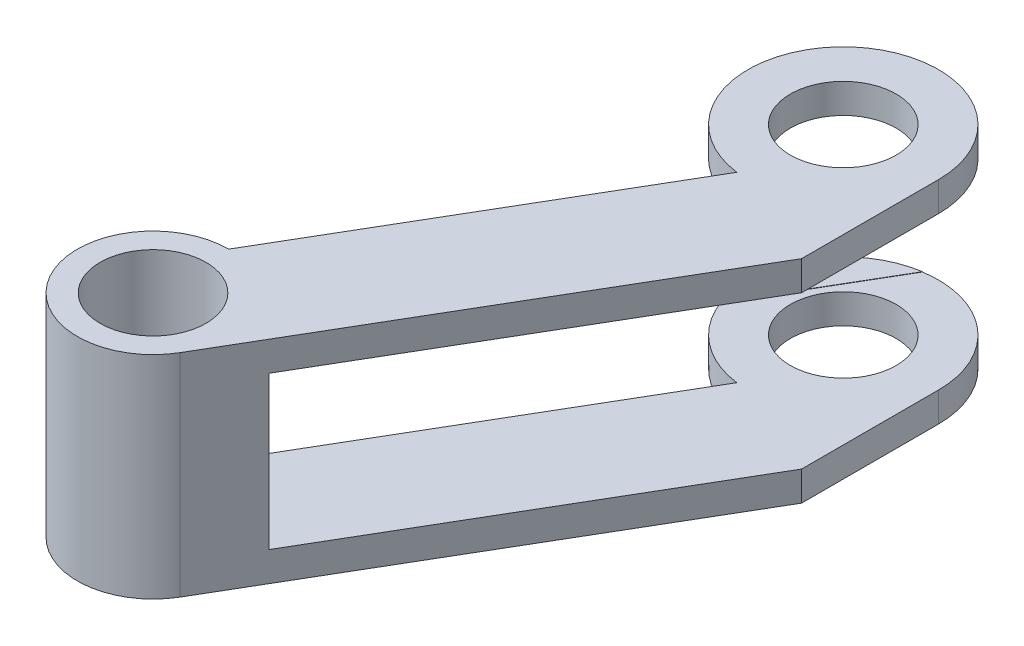
ISO-10303-21;
HEADER;
FILE_DESCRIPTION(('STEP AP214'),'2;1');
FILE_NAME('part.step','',(''),(''),'','','');
FILE_SCHEMA(('AUTOMOTIVE_DESIGN { 1 0 10303 214 1 1 1 1 }'));
ENDSEC;
DATA;
#1=APPLICATION_CONTEXT('core data for automotive mechanical design processes');
#2=APPLICATION_PROTOCOL_DEFINITION('international standard','automotive_design',2000,#1);
#3=PRODUCT_CONTEXT('',#1,'mechanical');
#4=PRODUCT('Part','Part','',(#3));
#5=PRODUCT_RELATED_PRODUCT_CATEGORY('part','',(#4));
#6=PRODUCT_DEFINITION_FORMATION('','',#4);
#7=PRODUCT_DEFINITION_CONTEXT('part definition',#1,'design');
#8=PRODUCT_DEFINITION('design','',#6,#7);
#9=PRODUCT_DEFINITION_SHAPE('','',#8);
#10=(LENGTH_UNIT() NAMED_UNIT(*) SI_UNIT(.MILLI.,.METRE.));
#11=(NAMED_UNIT(*) PLANE_ANGLE_UNIT() SI_UNIT($,.RADIAN.));
#12=(NAMED_UNIT(*) SI_UNIT($,.STERADIAN.) SOLID_ANGLE_UNIT());
#13=UNCERTAINTY_MEASURE_WITH_UNIT(LENGTH_MEASURE(1.E-05),#10,'distance_accuracy_value','');
#14=(GEOMETRIC_REPRESENTATION_CONTEXT(3) GLOBAL_UNCERTAINTY_ASSIGNED_CONTEXT((#13)) GLOBAL_UNIT_ASSIGNED_CONTEXT((#10,
#11,#12)) REPRESENTATION_CONTEXT('',''));
#15=CARTESIAN_POINT('',(0.,0.,0.));
#16=DIRECTION('',(0.,0.,1.));
#17=DIRECTION('',(1.,0.,0.));
#18=AXIS2_PLACEMENT_3D('',#15,#16,#17);
#19=CARTESIAN_POINT('',(-9.41695968201352,10.,19.6066988234628));
#20=DIRECTION('',(0.863195484814754,0.,0.504869839657135));
#21=DIRECTION('',(0.504869839657135,0.,-0.863195484814754));
#22=AXIS2_PLACEMENT_3D('',#19,#20,#21);
#23=PLANE('',#22);
#24=DIRECTION('',(0.,-1.,0.));
#25=VECTOR('',#24,1.);
#26=CARTESIAN_POINT('',(-0.560766753821935,10.,4.46492336415845));
#27=LINE('',#26,#25);
#28=CARTESIAN_POINT('',(-0.560766753821935,10.,4.46492336415845));
#29=VERTEX_POINT('',#28);
#30=CARTESIAN_POINT('',(-0.560766753821936,8.60510443723389,4.46492336415845));
#31=VERTEX_POINT('',#30);
#32=EDGE_CURVE('E48',#29,#31,#27,.T.);
#33=ORIENTED_EDGE('',*,*,#32,.T.);
#34=DIRECTION('',(-0.504869839657135,0.,0.863195484814754));
#35=VECTOR('',#34,1.);
#36=CARTESIAN_POINT('',(-9.41695968201352,8.60510443723389,19.6066988234628));
#37=LINE('',#36,#35);
#38=CARTESIAN_POINT('',(-9.41695968201352,8.60510443723389,19.6066988234628));
#39=VERTEX_POINT('',#38);
#40=EDGE_CURVE('E180',#31,#39,#37,.T.);
#41=ORIENTED_EDGE('',*,*,#40,.T.);
#42=DIRECTION('',(0.,-1.,0.));
#43=VECTOR('',#42,1.);
#44=CARTESIAN_POINT('',(-9.41695968201352,10.,19.6066988234628));
#45=LINE('',#44,#43);
#46=CARTESIAN_POINT('',(-9.41695968201352,10.,19.6066988234628));
#47=VERTEX_POINT('',#46);
#48=EDGE_CURVE('E159',#47,#39,#45,.T.);
#49=ORIENTED_EDGE('',*,*,#48,.F.);
#50=DIRECTION('',(-0.504869839657135,0.,0.863195484814754));
#51=VECTOR('',#50,1.);
#52=CARTESIAN_POINT('',(-9.41695968201352,10.,19.6066988234628));
#53=LINE('',#52,#51);
#54=EDGE_CURVE('E97',#29,#47,#53,.T.);
#55=ORIENTED_EDGE('',*,*,#54,.F.);
#56=EDGE_LOOP('',(#33,#41,#49,#55));
#57=FACE_BOUND('',#56,.T.);
#58=ADVANCED_FACE('F39',(#57),#23,.F.);
#59=CARTESIAN_POINT('',(4.5,10.,0.));
#60=DIRECTION('',(-1.,0.,0.));
#61=DIRECTION('',(0.,0.,1.));
#62=AXIS2_PLACEMENT_3D('',#59,#60,#61);
#63=PLANE('',#62);
#64=DIRECTION('',(0.,-1.,0.));
#65=VECTOR('',#64,1.);
#66=CARTESIAN_POINT('',(4.5,10.,6.46875));
#67=LINE('',#66,#65);
#68=CARTESIAN_POINT('',(4.5,10.,6.46875));
#69=VERTEX_POINT('',#68);
#70=CARTESIAN_POINT('',(4.5,8.60510443723389,6.46875));
#71=VERTEX_POINT('',#70);
#72=EDGE_CURVE('E123',#69,#71,#67,.T.);
#73=ORIENTED_EDGE('',*,*,#72,.T.);
#74=DIRECTION('',(0.,0.,-1.));
#75=VECTOR('',#74,1.);
#76=CARTESIAN_POINT('',(4.5,8.60510443723389,0.));
#77=LINE('',#76,#75);
#78=CARTESIAN_POINT('',(4.5,8.60510443723389,0.));
#79=VERTEX_POINT('',#78);
#80=EDGE_CURVE('E369',#71,#79,#77,.T.);
#81=ORIENTED_EDGE('',*,*,#80,.T.);
#82=DIRECTION('',(0.,-1.,0.));
#83=VECTOR('',#82,1.);
#84=CARTESIAN_POINT('',(4.5,10.,0.));
#85=LINE('',#84,#83);
#86=CARTESIAN_POINT('',(4.5,10.,0.));
#87=VERTEX_POINT('',#86);
#88=EDGE_CURVE('E152',#87,#79,#85,.T.);
#89=ORIENTED_EDGE('',*,*,#88,.F.);
#90=DIRECTION('',(0.,0.,-1.));
#91=VECTOR('',#90,1.);
#92=CARTESIAN_POINT('',(4.5,10.,0.));
#93=LINE('',#92,#91);
#94=EDGE_CURVE('E63',#69,#87,#93,.T.);
#95=ORIENTED_EDGE('',*,*,#94,.F.);
#96=EDGE_LOOP('',(#73,#81,#89,#95));
#97=FACE_BOUND('',#96,.T.);
#98=ADVANCED_FACE('F313',(#97),#63,.F.);
#99=CARTESIAN_POINT('',(13.5,1.41,4.5));
#100=DIRECTION('',(0.,1.,0.));
#101=DIRECTION('',(0.,0.,1.));
#102=AXIS2_PLACEMENT_3D('',#99,#100,#101);
#103=PLANE('',#102);
#104=CARTESIAN_POINT('',(0.,1.41,0.));
#105=DIRECTION('',(0.,1.,0.));
#106=DIRECTION('',(0.,0.,1.));
#107=AXIS2_PLACEMENT_3D('',#104,#105,#106);
#108=CIRCLE('',#107,4.5);
#109=CARTESIAN_POINT('',(-0.701592787062687,1.41,-4.44497104165388));
#110=VERTEX_POINT('',#109);
#111=CARTESIAN_POINT('',(-4.21817873142145,1.41,1.56747191036514));
#112=VERTEX_POINT('',#111);
#113=EDGE_CURVE('E139',#110,#112,#108,.T.);
#114=ORIENTED_EDGE('',*,*,#113,.T.);
#115=DIRECTION('',(0.504869839657135,0.,-0.863195484814754));
#116=VECTOR('',#115,1.);
#117=CARTESIAN_POINT('',(-0.979928913854226,1.41,-3.96908900427481));
#118=LINE('',#117,#116);
#119=EDGE_CURVE('E250',#112,#110,#118,.T.);
#120=ORIENTED_EDGE('',*,*,#119,.T.);
#121=EDGE_LOOP('',(#114,#120));
#122=FACE_BOUND('',#121,.T.);
#123=ADVANCED_FACE('F310',(#122),#103,.T.);
#124=CARTESIAN_POINT('',(13.5,8.59,4.5));
#125=DIRECTION('',(0.,-1.,0.));
#126=DIRECTION('',(1.,0.,0.));
#127=AXIS2_PLACEMENT_3D('',#124,#125,#126);
#128=PLANE('',#127);
#129=CARTESIAN_POINT('',(0.,8.59,0.));
#130=DIRECTION('',(0.,-1.,0.));
#131=DIRECTION('',(1.,0.,0.));
#132=AXIS2_PLACEMENT_3D('',#129,#130,#131);
#133=CIRCLE('',#132,4.5);
#134=CARTESIAN_POINT('',(-4.21817873142145,8.59,1.56747191036514));
#135=VERTEX_POINT('',#134);
#136=CARTESIAN_POINT('',(-0.701592787062687,8.59,-4.44497104165388));
#137=VERTEX_POINT('',#136);
#138=EDGE_CURVE('E275',#135,#137,#133,.T.);
#139=ORIENTED_EDGE('',*,*,#138,.T.);
#140=DIRECTION('',(-0.504869839657135,0.,0.863195484814754));
#141=VECTOR('',#140,1.);
#142=CARTESIAN_POINT('',(-0.979928913854226,8.59,-3.96908900427481));
#143=LINE('',#142,#141);
#144=EDGE_CURVE('E11',#137,#135,#143,.T.);
#145=ORIENTED_EDGE('',*,*,#144,.T.);
#146=EDGE_LOOP('',(#139,#145));
#147=FACE_BOUND('',#146,.T.);
#148=ADVANCED_FACE('F312',(#147),#128,.T.);
#149=CARTESIAN_POINT('',(0.,10.,0.));
#150=DIRECTION('',(0.,-1.,0.));
#151=DIRECTION('',(0.,0.,-1.));
#152=AXIS2_PLACEMENT_3D('',#149,#150,#151);
#153=CYLINDRICAL_SURFACE('',#152,4.5);
#154=CARTESIAN_POINT('',(-0.560766753821936,1.39489556276612,4.46492336415845));
#155=VERTEX_POINT('',#154);
#156=CARTESIAN_POINT('',(-0.560766753821935,0.,4.46492336415845));
#157=VERTEX_POINT('',#156);
#158=EDGE_CURVE('E162',#155,#157,#27,.T.);
#159=ORIENTED_EDGE('',*,*,#158,.F.);
#160=CARTESIAN_POINT('',(0.,1.39489556276612,0.));
#161=DIRECTION('',(0.,-1.,0.));
#162=DIRECTION('',(0.,0.,-1.));
#163=AXIS2_PLACEMENT_3D('',#160,#161,#162);
#164=CIRCLE('',#163,4.5);
#165=CARTESIAN_POINT('',(-4.21817873142145,1.39489556276612,1.56747191036514));
#166=VERTEX_POINT('',#165);
#167=EDGE_CURVE('E184',#155,#166,#164,.T.);
#168=ORIENTED_EDGE('',*,*,#167,.T.);
#169=DIRECTION('',(0.,-1.,0.));
#170=VECTOR('',#169,1.);
#171=CARTESIAN_POINT('',(-4.21817873142145,10.,1.56747191036514));
#172=LINE('',#171,#170);
#173=EDGE_CURVE('E243',#112,#166,#172,.T.);
#174=ORIENTED_EDGE('',*,*,#173,.F.);
#175=ORIENTED_EDGE('',*,*,#113,.F.);
#176=DIRECTION('',(0.,-1.,0.));
#177=VECTOR('',#176,1.);
#178=CARTESIAN_POINT('',(-0.701592787062687,10.,-4.44497104165388));
#179=LINE('',#178,#177);
#180=CARTESIAN_POINT('',(-0.701592787062688,1.39489556276612,-4.44497104165388));
#181=VERTEX_POINT('',#180);
#182=EDGE_CURVE('E241',#181,#110,#179,.F.);
#183=ORIENTED_EDGE('',*,*,#182,.F.);
#184=CARTESIAN_POINT('',(4.5,1.39489556276612,0.));
#185=VERTEX_POINT('',#184);
#186=EDGE_CURVE('E174',#181,#185,#164,.T.);
#187=ORIENTED_EDGE('',*,*,#186,.T.);
#188=CARTESIAN_POINT('',(4.5,0.,0.));
#189=VERTEX_POINT('',#188);
#190=EDGE_CURVE('E88',#185,#189,#85,.T.);
#191=ORIENTED_EDGE('',*,*,#190,.T.);
#192=CARTESIAN_POINT('',(0.,0.,0.));
#193=DIRECTION('',(0.,1.,0.));
#194=DIRECTION('',(0.,0.,1.));
#195=AXIS2_PLACEMENT_3D('',#192,#193,#194);
#196=CIRCLE('',#195,4.5);
#197=EDGE_CURVE('E135',#189,#157,#196,.T.);
#198=ORIENTED_EDGE('',*,*,#197,.T.);
#199=EDGE_LOOP('',(#159,#168,#174,#175,#183,#187,#191,#198));
#200=FACE_BOUND('',#199,.T.);
#201=ADVANCED_FACE('F41',(#200),#153,.T.);
#202=DIRECTION('',(0.,-1.,0.));
#203=VECTOR('',#202,1.);
#204=CARTESIAN_POINT('',(-4.21817873142145,10.,1.56747191036514));
#205=LINE('',#204,#203);
#206=CARTESIAN_POINT('',(-4.21817873142145,8.60510443723389,1.56747191036514));
#207=VERTEX_POINT('',#206);
#208=EDGE_CURVE('E55',#207,#135,#205,.T.);
#209=ORIENTED_EDGE('',*,*,#208,.F.);
#210=CARTESIAN_POINT('',(0.,8.60510443723389,0.));
#211=DIRECTION('',(0.,1.,0.));
#212=DIRECTION('',(0.,0.,1.));
#213=AXIS2_PLACEMENT_3D('',#210,#211,#212);
#214=CIRCLE('',#213,4.5);
#215=EDGE_CURVE('E293',#207,#31,#214,.T.);
#216=ORIENTED_EDGE('',*,*,#215,.T.);
#217=ORIENTED_EDGE('',*,*,#32,.F.);
#218=CARTESIAN_POINT('',(0.,10.,0.));
#219=DIRECTION('',(0.,1.,0.));
#220=DIRECTION('',(0.,0.,1.));
#221=AXIS2_PLACEMENT_3D('',#218,#219,#220);
#222=CIRCLE('',#221,4.5);
#223=EDGE_CURVE('E151',#87,#29,#222,.T.);
#224=ORIENTED_EDGE('',*,*,#223,.F.);
#225=ORIENTED_EDGE('',*,*,#88,.T.);
#226=CARTESIAN_POINT('',(-0.701592787062688,8.60510443723389,-4.44497104165388));
#227=VERTEX_POINT('',#226);
#228=EDGE_CURVE('E535',#79,#227,#214,.T.);
#229=ORIENTED_EDGE('',*,*,#228,.T.);
#230=DIRECTION('',(0.,-1.,0.));
#231=VECTOR('',#230,1.);
#232=CARTESIAN_POINT('',(-0.701592787062687,10.,-4.44497104165388));
#233=LINE('',#232,#231);
#234=EDGE_CURVE('E537',#137,#227,#233,.F.);
#235=ORIENTED_EDGE('',*,*,#234,.F.);
#236=ORIENTED_EDGE('',*,*,#138,.F.);
#237=EDGE_LOOP('',(#209,#216,#217,#224,#225,#229,#235,#236));
#238=FACE_BOUND('',#237,.T.);
#239=ADVANCED_FACE('F290',(#238),#153,.T.);
#240=CARTESIAN_POINT('',(-9.41695968201352,1.39489556276612,19.6066988234628));
#241=VERTEX_POINT('',#240);
#242=CARTESIAN_POINT('',(-9.41695968201352,0.,19.6066988234628));
#243=VERTEX_POINT('',#242);
#244=EDGE_CURVE('E122',#241,#243,#45,.T.);
#245=ORIENTED_EDGE('',*,*,#244,.F.);
#246=DIRECTION('',(0.504869839657135,0.,-0.863195484814754));
#247=VECTOR('',#246,1.);
#248=CARTESIAN_POINT('',(-9.41695968201352,1.39489556276612,19.6066988234628));
#249=LINE('',#248,#247);
#250=EDGE_CURVE('E194',#241,#155,#249,.T.);
#251=ORIENTED_EDGE('',*,*,#250,.T.);
#252=ORIENTED_EDGE('',*,*,#158,.T.);
#253=DIRECTION('',(-0.504869839657135,0.,0.863195484814754));
#254=VECTOR('',#253,1.);
#255=CARTESIAN_POINT('',(-9.41695968201352,0.,19.6066988234628));
#256=LINE('',#255,#254);
#257=EDGE_CURVE('E138',#157,#243,#256,.T.);
#258=ORIENTED_EDGE('',*,*,#257,.T.);
#259=EDGE_LOOP('',(#245,#251,#252,#258));
#260=FACE_BOUND('',#259,.T.);
#261=ADVANCED_FACE('F326',(#260),#23,.F.);
#262=ORIENTED_EDGE('',*,*,#190,.F.);
#263=DIRECTION('',(0.,0.,1.));
#264=VECTOR('',#263,1.);
#265=CARTESIAN_POINT('',(4.5,1.39489556276612,0.));
#266=LINE('',#265,#264);
#267=CARTESIAN_POINT('',(4.5,1.39489556276612,6.46875));
#268=VERTEX_POINT('',#267);
#269=EDGE_CURVE('E182',#185,#268,#266,.T.);
#270=ORIENTED_EDGE('',*,*,#269,.T.);
#271=CARTESIAN_POINT('',(4.5,0.,6.46875));
#272=VERTEX_POINT('',#271);
#273=EDGE_CURVE('E156',#268,#272,#67,.T.);
#274=ORIENTED_EDGE('',*,*,#273,.T.);
#275=DIRECTION('',(0.,0.,-1.));
#276=VECTOR('',#275,1.);
#277=CARTESIAN_POINT('',(4.5,0.,0.));
#278=LINE('',#277,#276);
#279=EDGE_CURVE('E148',#272,#189,#278,.T.);
#280=ORIENTED_EDGE('',*,*,#279,.T.);
#281=EDGE_LOOP('',(#262,#270,#274,#280));
#282=FACE_BOUND('',#281,.T.);
#283=ADVANCED_FACE('F323',(#282),#63,.F.);
#284=CARTESIAN_POINT('',(-9.41695968201352,10.,23.181827051937));
#285=DIRECTION('',(0.,-1.,0.));
#286=DIRECTION('',(0.,0.,-1.));
#287=AXIS2_PLACEMENT_3D('',#284,#285,#286);
#288=CYLINDRICAL_SURFACE('',#287,3.57512822847424);
#289=ORIENTED_EDGE('',*,*,#48,.T.);
#290=CARTESIAN_POINT('',(-9.41695968201352,8.60510443723389,23.181827051937));
#291=DIRECTION('',(0.,1.,0.));
#292=DIRECTION('',(0.,0.,1.));
#293=AXIS2_PLACEMENT_3D('',#290,#291,#292);
#294=CIRCLE('',#293,3.57512822847424);
#295=CARTESIAN_POINT('',(-9.46732418483107,8.60510443723389,19.6070535952143));
#296=VERTEX_POINT('',#295);
#297=EDGE_CURVE('E173',#39,#296,#294,.T.);
#298=ORIENTED_EDGE('',*,*,#297,.T.);
#299=DIRECTION('',(0.,-1.,0.));
#300=VECTOR('',#299,1.);
#301=CARTESIAN_POINT('',(-9.46732418483107,10.,19.6070535952143));
#302=LINE('',#301,#300);
#303=CARTESIAN_POINT('',(-9.46732418483107,1.39489556276612,19.6070535952143));
#304=VERTEX_POINT('',#303);
#305=EDGE_CURVE('E254',#296,#304,#302,.T.);
#306=ORIENTED_EDGE('',*,*,#305,.T.);
#307=CARTESIAN_POINT('',(-9.41695968201352,1.39489556276612,23.181827051937));
#308=DIRECTION('',(0.,-1.,0.));
#309=DIRECTION('',(0.,0.,-1.));
#310=AXIS2_PLACEMENT_3D('',#307,#308,#309);
#311=CIRCLE('',#310,3.57512822847424);
#312=EDGE_CURVE('E168',#304,#241,#311,.T.);
#313=ORIENTED_EDGE('',*,*,#312,.T.);
#314=ORIENTED_EDGE('',*,*,#244,.T.);
#315=CARTESIAN_POINT('',(-9.41695968201352,0.,23.181827051937));
#316=DIRECTION('',(0.,1.,0.));
#317=DIRECTION('',(0.,0.,1.));
#318=AXIS2_PLACEMENT_3D('',#315,#316,#317);
#319=CIRCLE('',#318,3.57512822847424);
#320=CARTESIAN_POINT('',(-6.33092513756078,0.,24.9868014674005));
#321=VERTEX_POINT('',#320);
#322=EDGE_CURVE('E117',#243,#321,#319,.T.);
#323=ORIENTED_EDGE('',*,*,#322,.T.);
#324=DIRECTION('',(0.,-1.,0.));
#325=VECTOR('',#324,1.);
#326=CARTESIAN_POINT('',(-6.33092513756078,10.,24.9868014674005));
#327=LINE('',#326,#325);
#328=CARTESIAN_POINT('',(-6.33092513756078,10.,24.9868014674005));
#329=VERTEX_POINT('',#328);
#330=EDGE_CURVE('E114',#329,#321,#327,.T.);
#331=ORIENTED_EDGE('',*,*,#330,.F.);
#332=CARTESIAN_POINT('',(-9.41695968201352,10.,23.181827051937));
#333=DIRECTION('',(0.,1.,0.));
#334=DIRECTION('',(0.,0.,1.));
#335=AXIS2_PLACEMENT_3D('',#332,#333,#334);
#336=CIRCLE('',#335,3.57512822847424);
#337=EDGE_CURVE('E103',#47,#329,#336,.T.);
#338=ORIENTED_EDGE('',*,*,#337,.F.);
#339=EDGE_LOOP('',(#289,#298,#306,#313,#314,#323,#331,#338));
#340=FACE_BOUND('',#339,.T.);
#341=ADVANCED_FACE('F115',(#340),#288,.T.);
#342=CARTESIAN_POINT('',(4.5,10.,6.46875));
#343=DIRECTION('',(-0.863195484814754,0.,-0.504869839657135));
#344=DIRECTION('',(-0.504869839657135,0.,0.863195484814754));
#345=AXIS2_PLACEMENT_3D('',#342,#343,#344);
#346=PLANE('',#345);
#347=DIRECTION('',(0.,-1.,0.));
#348=VECTOR('',#347,1.);
#349=CARTESIAN_POINT('',(-4.78587156910922,1.39489556276612,22.3451636444915));
#350=LINE('',#349,#348);
#351=CARTESIAN_POINT('',(-4.78587156910922,8.60510443723389,22.3451636444915));
#352=VERTEX_POINT('',#351);
#353=CARTESIAN_POINT('',(-4.78587156910922,1.39489556276612,22.3451636444915));
#354=VERTEX_POINT('',#353);
#355=EDGE_CURVE('E226',#352,#354,#350,.T.);
#356=ORIENTED_EDGE('',*,*,#355,.F.);
#357=DIRECTION('',(-0.504869839657135,0.,0.863195484814754));
#358=VECTOR('',#357,1.);
#359=CARTESIAN_POINT('',(15.5018394477783,8.60510443723389,-12.341520271697));
#360=LINE('',#359,#358);
#361=EDGE_CURVE('E217',#71,#352,#360,.T.);
#362=ORIENTED_EDGE('',*,*,#361,.F.);
#363=ORIENTED_EDGE('',*,*,#72,.F.);
#364=DIRECTION('',(0.504869839657135,0.,-0.863195484814754));
#365=VECTOR('',#364,1.);
#366=CARTESIAN_POINT('',(4.5,10.,6.46875));
#367=LINE('',#366,#365);
#368=EDGE_CURVE('E107',#329,#69,#367,.T.);
#369=ORIENTED_EDGE('',*,*,#368,.F.);
#370=ORIENTED_EDGE('',*,*,#330,.T.);
#371=DIRECTION('',(0.504869839657135,0.,-0.863195484814754));
#372=VECTOR('',#371,1.);
#373=CARTESIAN_POINT('',(4.5,0.,6.46875));
#374=LINE('',#373,#372);
#375=EDGE_CURVE('E145',#321,#272,#374,.T.);
#376=ORIENTED_EDGE('',*,*,#375,.T.);
#377=ORIENTED_EDGE('',*,*,#273,.F.);
#378=DIRECTION('',(0.504869839657135,0.,-0.863195484814754));
#379=VECTOR('',#378,1.);
#380=CARTESIAN_POINT('',(15.5018394477783,1.39489556276612,-12.341520271697));
#381=LINE('',#380,#379);
#382=EDGE_CURVE('E222',#354,#268,#381,.T.);
#383=ORIENTED_EDGE('',*,*,#382,.F.);
#384=EDGE_LOOP('',(#356,#362,#363,#369,#370,#376,#377,#383));
#385=FACE_BOUND('',#384,.T.);
#386=ADVANCED_FACE('F126',(#385),#346,.F.);
#387=CARTESIAN_POINT('',(0.,10.,0.));
#388=DIRECTION('',(0.,1.,0.));
#389=DIRECTION('',(0.,0.,1.));
#390=AXIS2_PLACEMENT_3D('',#387,#388,#389);
#391=PLANE('',#390);
#392=CARTESIAN_POINT('',(-9.41695968201352,10.,23.181827051937));
#393=DIRECTION('',(0.,1.,0.));
#394=DIRECTION('',(0.,0.,1.));
#395=AXIS2_PLACEMENT_3D('',#392,#393,#394);
#396=CIRCLE('',#395,2.5);
#397=CARTESIAN_POINT('',(-9.41695968201352,10.,25.681827051937));
#398=VERTEX_POINT('',#397);
#399=EDGE_CURVE('E262',#398,#398,#396,.T.);
#400=ORIENTED_EDGE('',*,*,#399,.F.);
#401=EDGE_LOOP('',(#400));
#402=FACE_BOUND('',#401,.T.);
#403=CARTESIAN_POINT('',(0.,10.,0.));
#404=DIRECTION('',(0.,1.,0.));
#405=DIRECTION('',(0.,0.,1.));
#406=AXIS2_PLACEMENT_3D('',#403,#404,#405);
#407=CIRCLE('',#406,2.5);
#408=CARTESIAN_POINT('',(0.,10.,2.5));
#409=VERTEX_POINT('',#408);
#410=EDGE_CURVE('E267',#409,#409,#407,.T.);
#411=ORIENTED_EDGE('',*,*,#410,.F.);
#412=EDGE_LOOP('',(#411));
#413=FACE_BOUND('',#412,.T.);
#414=ORIENTED_EDGE('',*,*,#223,.T.);
#415=ORIENTED_EDGE('',*,*,#54,.T.);
#416=ORIENTED_EDGE('',*,*,#337,.T.);
#417=ORIENTED_EDGE('',*,*,#368,.T.);
#418=ORIENTED_EDGE('',*,*,#94,.T.);
#419=EDGE_LOOP('',(#414,#415,#416,#417,#418));
#420=FACE_BOUND('',#419,.T.);
#421=ADVANCED_FACE('F105',(#402,#413,#420),#391,.T.);
#422=CARTESIAN_POINT('',(0.,0.,0.));
#423=DIRECTION('',(0.,1.,0.));
#424=DIRECTION('',(0.,0.,1.));
#425=AXIS2_PLACEMENT_3D('',#422,#423,#424);
#426=PLANE('',#425);
#427=CARTESIAN_POINT('',(-9.41695968201352,0.,23.181827051937));
#428=DIRECTION('',(0.,1.,0.));
#429=DIRECTION('',(0.,0.,1.));
#430=AXIS2_PLACEMENT_3D('',#427,#428,#429);
#431=CIRCLE('',#430,2.5);
#432=CARTESIAN_POINT('',(-9.41695968201352,0.,25.681827051937));
#433=VERTEX_POINT('',#432);
#434=EDGE_CURVE('E263',#433,#433,#431,.T.);
#435=ORIENTED_EDGE('',*,*,#434,.T.);
#436=EDGE_LOOP('',(#435));
#437=FACE_BOUND('',#436,.T.);
#438=CARTESIAN_POINT('',(0.,0.,0.));
#439=DIRECTION('',(0.,1.,0.));
#440=DIRECTION('',(0.,0.,1.));
#441=AXIS2_PLACEMENT_3D('',#438,#439,#440);
#442=CIRCLE('',#441,2.5);
#443=CARTESIAN_POINT('',(0.,0.,2.5));
#444=VERTEX_POINT('',#443);
#445=EDGE_CURVE('E271',#444,#444,#442,.T.);
#446=ORIENTED_EDGE('',*,*,#445,.T.);
#447=EDGE_LOOP('',(#446));
#448=FACE_BOUND('',#447,.T.);
#449=ORIENTED_EDGE('',*,*,#197,.F.);
#450=ORIENTED_EDGE('',*,*,#279,.F.);
#451=ORIENTED_EDGE('',*,*,#375,.F.);
#452=ORIENTED_EDGE('',*,*,#322,.F.);
#453=ORIENTED_EDGE('',*,*,#257,.F.);
#454=EDGE_LOOP('',(#449,#450,#451,#452,#453));
#455=FACE_BOUND('',#454,.T.);
#456=ADVANCED_FACE('F349',(#437,#448,#455),#426,.F.);
#457=CARTESIAN_POINT('',(0.,0.,0.));
#458=DIRECTION('',(0.,1.,0.));
#459=DIRECTION('',(0.,0.,1.));
#460=AXIS2_PLACEMENT_3D('',#457,#458,#459);
#461=CYLINDRICAL_SURFACE('',#460,2.5);
#462=CARTESIAN_POINT('',(0.,8.60510443723389,0.));
#463=DIRECTION('',(0.,1.,0.));
#464=DIRECTION('',(0.,0.,1.));
#465=AXIS2_PLACEMENT_3D('',#462,#463,#464);
#466=CIRCLE('',#465,2.5);
#467=CARTESIAN_POINT('',(0.,8.60510443723389,2.5));
#468=VERTEX_POINT('',#467);
#469=EDGE_CURVE('E170',#468,#468,#466,.F.);
#470=ORIENTED_EDGE('',*,*,#469,.T.);
#471=EDGE_LOOP('',(#470));
#472=FACE_BOUND('',#471,.T.);
#473=ORIENTED_EDGE('',*,*,#410,.T.);
#474=EDGE_LOOP('',(#473));
#475=FACE_BOUND('',#474,.T.);
#476=ADVANCED_FACE('F397',(#472,#475),#461,.F.);
#477=CARTESIAN_POINT('',(0.,1.39489556276612,0.));
#478=DIRECTION('',(0.,-1.,0.));
#479=DIRECTION('',(0.,0.,-1.));
#480=AXIS2_PLACEMENT_3D('',#477,#478,#479);
#481=CIRCLE('',#480,2.5);
#482=CARTESIAN_POINT('',(0.,1.39489556276612,-2.5));
#483=VERTEX_POINT('',#482);
#484=EDGE_CURVE('E165',#483,#483,#481,.F.);
#485=ORIENTED_EDGE('',*,*,#484,.T.);
#486=EDGE_LOOP('',(#485));
#487=FACE_BOUND('',#486,.T.);
#488=ORIENTED_EDGE('',*,*,#445,.F.);
#489=EDGE_LOOP('',(#488));
#490=FACE_BOUND('',#489,.T.);
#491=ADVANCED_FACE('F395',(#487,#490),#461,.F.);
#492=CARTESIAN_POINT('',(-9.41695968201352,0.,23.181827051937));
#493=DIRECTION('',(0.,1.,0.));
#494=DIRECTION('',(0.,0.,1.));
#495=AXIS2_PLACEMENT_3D('',#492,#493,#494);
#496=CYLINDRICAL_SURFACE('',#495,2.5);
#497=ORIENTED_EDGE('',*,*,#434,.F.);
#498=EDGE_LOOP('',(#497));
#499=FACE_BOUND('',#498,.T.);
#500=ORIENTED_EDGE('',*,*,#399,.T.);
#501=EDGE_LOOP('',(#500));
#502=FACE_BOUND('',#501,.T.);
#503=ADVANCED_FACE('F392',(#499,#502),#496,.F.);
#504=CARTESIAN_POINT('',(-13.4178264172568,1.39489556276612,17.2964652479201));
#505=DIRECTION('',(-0.504869839657135,0.,0.863195484814754));
#506=DIRECTION('',(0.863195484814754,0.,0.504869839657135));
#507=AXIS2_PLACEMENT_3D('',#504,#505,#506);
#508=PLANE('',#507);
#509=DIRECTION('',(0.863195484814754,0.,0.504869839657135));
#510=VECTOR('',#509,1.);
#511=CARTESIAN_POINT('',(-13.4178264172568,8.60510443723389,17.2964652479201));
#512=LINE('',#511,#510);
#513=EDGE_CURVE('E169',#296,#352,#512,.T.);
#514=ORIENTED_EDGE('',*,*,#513,.T.);
#515=ORIENTED_EDGE('',*,*,#355,.T.);
#516=DIRECTION('',(0.863195484814754,0.,0.504869839657135));
#517=VECTOR('',#516,1.);
#518=CARTESIAN_POINT('',(-13.4178264172568,1.39489556276612,17.2964652479201));
#519=LINE('',#518,#517);
#520=EDGE_CURVE('E209',#304,#354,#519,.T.);
#521=ORIENTED_EDGE('',*,*,#520,.F.);
#522=ORIENTED_EDGE('',*,*,#305,.F.);
#523=EDGE_LOOP('',(#514,#515,#521,#522));
#524=FACE_BOUND('',#523,.T.);
#525=ADVANCED_FACE('F364',(#524),#508,.F.);
#526=CARTESIAN_POINT('',(-2.45988575924207,0.,-1.43874956564437));
#527=DIRECTION('',(0.863195484814754,0.,0.504869839657135));
#528=DIRECTION('',(0.504869839657135,0.,-0.863195484814754));
#529=AXIS2_PLACEMENT_3D('',#526,#527,#528);
#530=PLANE('',#529);
#531=ORIENTED_EDGE('',*,*,#173,.T.);
#532=DIRECTION('',(0.504869839657135,0.,-0.863195484814754));
#533=VECTOR('',#532,1.);
#534=CARTESIAN_POINT('',(6.86988459963073,1.39489556276612,-17.3902186682684));
#535=LINE('',#534,#533);
#536=EDGE_CURVE('E221',#166,#181,#535,.T.);
#537=ORIENTED_EDGE('',*,*,#536,.T.);
#538=ORIENTED_EDGE('',*,*,#182,.T.);
#539=ORIENTED_EDGE('',*,*,#119,.F.);
#540=EDGE_LOOP('',(#531,#537,#538,#539));
#541=FACE_BOUND('',#540,.T.);
#542=ADVANCED_FACE('F239',(#541),#530,.T.);
#543=ORIENTED_EDGE('',*,*,#208,.T.);
#544=ORIENTED_EDGE('',*,*,#144,.F.);
#545=ORIENTED_EDGE('',*,*,#234,.T.);
#546=DIRECTION('',(-0.504869839657135,0.,0.863195484814754));
#547=VECTOR('',#546,1.);
#548=CARTESIAN_POINT('',(6.86988459963073,8.60510443723389,-17.3902186682684));
#549=LINE('',#548,#547);
#550=EDGE_CURVE('E213',#227,#207,#549,.T.);
#551=ORIENTED_EDGE('',*,*,#550,.T.);
#552=EDGE_LOOP('',(#543,#544,#545,#551));
#553=FACE_BOUND('',#552,.T.);
#554=ADVANCED_FACE('F384',(#553),#530,.T.);
#555=CARTESIAN_POINT('',(6.86988459963073,8.60510443723389,-17.3902186682684));
#556=DIRECTION('',(0.,1.,0.));
#557=DIRECTION('',(0.,0.,1.));
#558=AXIS2_PLACEMENT_3D('',#555,#556,#557);
#559=PLANE('',#558);
#560=ORIENTED_EDGE('',*,*,#469,.F.);
#561=EDGE_LOOP('',(#560));
#562=FACE_BOUND('',#561,.T.);
#563=ORIENTED_EDGE('',*,*,#80,.F.);
#564=ORIENTED_EDGE('',*,*,#361,.T.);
#565=ORIENTED_EDGE('',*,*,#513,.F.);
#566=ORIENTED_EDGE('',*,*,#297,.F.);
#567=ORIENTED_EDGE('',*,*,#40,.F.);
#568=ORIENTED_EDGE('',*,*,#215,.F.);
#569=ORIENTED_EDGE('',*,*,#550,.F.);
#570=ORIENTED_EDGE('',*,*,#228,.F.);
#571=EDGE_LOOP('',(#563,#564,#565,#566,#567,#568,#569,#570));
#572=FACE_BOUND('',#571,.T.);
#573=ADVANCED_FACE('F367',(#562,#572),#559,.F.);
#574=CARTESIAN_POINT('',(6.86988459963073,1.39489556276612,-17.3902186682684));
#575=DIRECTION('',(0.,-1.,0.));
#576=DIRECTION('',(0.,0.,-1.));
#577=AXIS2_PLACEMENT_3D('',#574,#575,#576);
#578=PLANE('',#577);
#579=ORIENTED_EDGE('',*,*,#484,.F.);
#580=EDGE_LOOP('',(#579));
#581=FACE_BOUND('',#580,.T.);
#582=ORIENTED_EDGE('',*,*,#536,.F.);
#583=ORIENTED_EDGE('',*,*,#167,.F.);
#584=ORIENTED_EDGE('',*,*,#250,.F.);
#585=ORIENTED_EDGE('',*,*,#312,.F.);
#586=ORIENTED_EDGE('',*,*,#520,.T.);
#587=ORIENTED_EDGE('',*,*,#382,.T.);
#588=ORIENTED_EDGE('',*,*,#269,.F.);
#589=ORIENTED_EDGE('',*,*,#186,.F.);
#590=EDGE_LOOP('',(#582,#583,#584,#585,#586,#587,#588,#589));
#591=FACE_BOUND('',#590,.T.);
#592=ADVANCED_FACE('F377',(#581,#591),#578,.F.);
#593=CLOSED_SHELL('',(#58,#98,#123,#148,#201,#239,#261,#283,#341,#386,#421,#456,#476,#491,#503,
#525,#542,#554,#573,#592));
#594=MANIFOLD_SOLID_BREP('B2',#593);
#595=ADVANCED_BREP_SHAPE_REPRESENTATION('',(#18,#594),#14);
#596=SHAPE_DEFINITION_REPRESENTATION(#9,#595);
ENDSEC;
END-ISO-10303-21;
